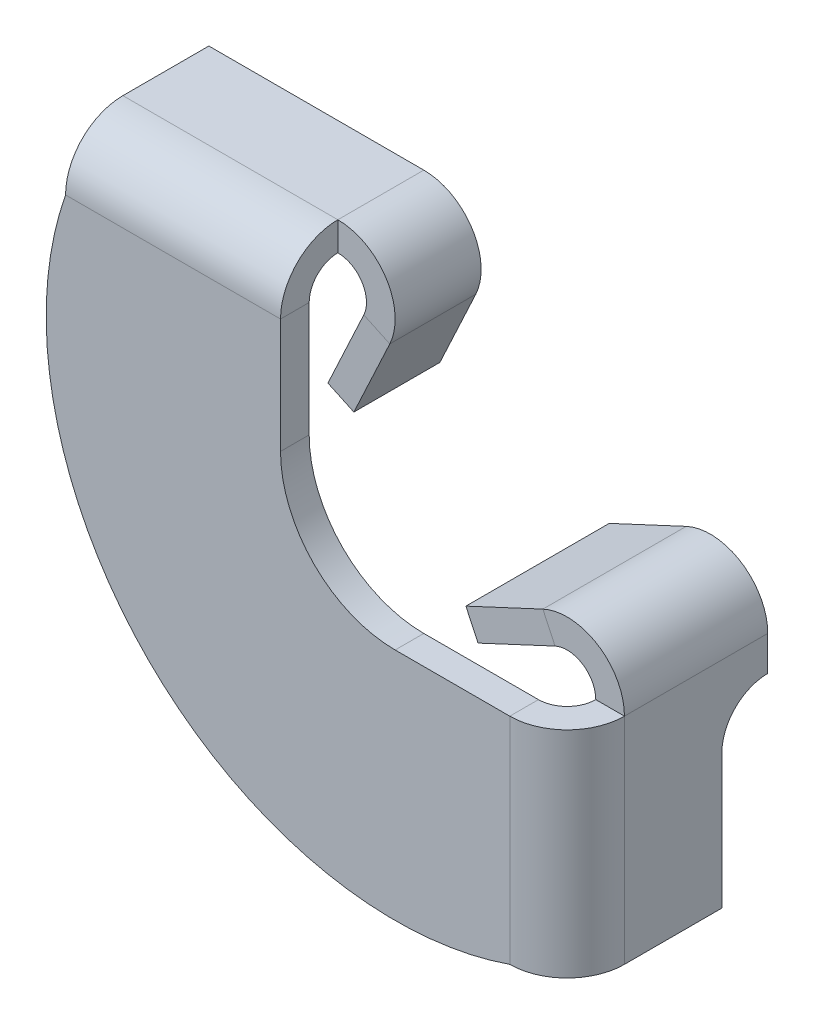
ISO-10303-21;
HEADER;
FILE_DESCRIPTION(('STEP AP214'),'2;1');
FILE_NAME('part.step','',(''),(''),'','','');
FILE_SCHEMA(('AUTOMOTIVE_DESIGN { 1 0 10303 214 1 1 1 1 }'));
ENDSEC;
DATA;
#1=APPLICATION_CONTEXT('core data for automotive mechanical design processes');
#2=APPLICATION_PROTOCOL_DEFINITION('international standard','automotive_design',2000,#1);
#3=PRODUCT_CONTEXT('',#1,'mechanical');
#4=PRODUCT('Part','Part','',(#3));
#5=PRODUCT_RELATED_PRODUCT_CATEGORY('part','',(#4));
#6=PRODUCT_DEFINITION_FORMATION('','',#4);
#7=PRODUCT_DEFINITION_CONTEXT('part definition',#1,'design');
#8=PRODUCT_DEFINITION('design','',#6,#7);
#9=PRODUCT_DEFINITION_SHAPE('','',#8);
#10=(LENGTH_UNIT() NAMED_UNIT(*) SI_UNIT(.MILLI.,.METRE.));
#11=(NAMED_UNIT(*) PLANE_ANGLE_UNIT() SI_UNIT($,.RADIAN.));
#12=(NAMED_UNIT(*) SI_UNIT($,.STERADIAN.) SOLID_ANGLE_UNIT());
#13=UNCERTAINTY_MEASURE_WITH_UNIT(LENGTH_MEASURE(1.E-05),#10,'distance_accuracy_value','');
#14=(GEOMETRIC_REPRESENTATION_CONTEXT(3) GLOBAL_UNCERTAINTY_ASSIGNED_CONTEXT((#13)) GLOBAL_UNIT_ASSIGNED_CONTEXT((#10,
#11,#12)) REPRESENTATION_CONTEXT('',''));
#15=CARTESIAN_POINT('',(0.,0.,0.));
#16=DIRECTION('',(0.,0.,1.));
#17=DIRECTION('',(1.,0.,0.));
#18=AXIS2_PLACEMENT_3D('',#15,#16,#17);
#19=CARTESIAN_POINT('',(8.,-7.99999999999995,6.));
#20=DIRECTION('',(0.,-1.,0.));
#21=DIRECTION('',(1.,0.,0.));
#22=AXIS2_PLACEMENT_3D('',#19,#20,#21);
#23=PLANE('',#22);
#24=DIRECTION('',(1.,0.,0.));
#25=VECTOR('',#24,1.);
#26=CARTESIAN_POINT('',(12.,-7.99999999999997,6.));
#27=LINE('',#26,#25);
#28=CARTESIAN_POINT('',(10.,-7.99999999999997,6.));
#29=VERTEX_POINT('',#28);
#30=CARTESIAN_POINT('',(12.,-7.99999999999997,6.));
#31=VERTEX_POINT('',#30);
#32=EDGE_CURVE('E11',#29,#31,#27,.T.);
#33=ORIENTED_EDGE('',*,*,#32,.F.);
#34=CARTESIAN_POINT('',(8.,-7.99999999999997,6.));
#35=DIRECTION('',(0.,1.,0.));
#36=DIRECTION('',(-1.,0.,0.));
#37=AXIS2_PLACEMENT_3D('',#34,#35,#36);
#38=CIRCLE('',#37,2.);
#39=CARTESIAN_POINT('',(8.,-8.00000000000002,8.));
#40=VERTEX_POINT('',#39);
#41=EDGE_CURVE('E136',#29,#40,#38,.F.);
#42=ORIENTED_EDGE('',*,*,#41,.T.);
#43=DIRECTION('',(0.,0.,1.));
#44=VECTOR('',#43,1.);
#45=CARTESIAN_POINT('',(8.,-8.00000000000002,10.));
#46=LINE('',#45,#44);
#47=CARTESIAN_POINT('',(8.,-8.00000000000002,10.));
#48=VERTEX_POINT('',#47);
#49=EDGE_CURVE('E49',#40,#48,#46,.T.);
#50=ORIENTED_EDGE('',*,*,#49,.T.);
#51=CARTESIAN_POINT('',(8.,-7.99999999999995,6.));
#52=DIRECTION('',(0.,1.,0.));
#53=DIRECTION('',(-1.,0.,0.));
#54=AXIS2_PLACEMENT_3D('',#51,#52,#53);
#55=CIRCLE('',#54,4.);
#56=EDGE_CURVE('E139',#31,#48,#55,.F.);
#57=ORIENTED_EDGE('',*,*,#56,.F.);
#58=EDGE_LOOP('',(#33,#42,#50,#57));
#59=FACE_BOUND('',#58,.T.);
#60=ADVANCED_FACE('F39',(#59),#23,.F.);
#61=CARTESIAN_POINT('',(1.45916076828845,-8.,10.));
#62=DIRECTION('',(0.,-1.,0.));
#63=DIRECTION('',(-1.,0.,0.));
#64=AXIS2_PLACEMENT_3D('',#61,#62,#63);
#65=PLANE('',#64);
#66=ORIENTED_EDGE('',*,*,#49,.F.);
#67=DIRECTION('',(-1.,0.,0.));
#68=VECTOR('',#67,1.);
#69=CARTESIAN_POINT('',(0.,-8.00000000000002,8.));
#70=LINE('',#69,#68);
#71=CARTESIAN_POINT('',(0.,-7.99999999999999,8.));
#72=VERTEX_POINT('',#71);
#73=EDGE_CURVE('E348',#40,#72,#70,.T.);
#74=ORIENTED_EDGE('',*,*,#73,.T.);
#75=DIRECTION('',(0.,0.,1.));
#76=VECTOR('',#75,1.);
#77=CARTESIAN_POINT('',(0.,-7.99999999999999,10.));
#78=LINE('',#77,#76);
#79=CARTESIAN_POINT('',(0.,-7.99999999999999,10.));
#80=VERTEX_POINT('',#79);
#81=EDGE_CURVE('E250',#72,#80,#78,.T.);
#82=ORIENTED_EDGE('',*,*,#81,.T.);
#83=DIRECTION('',(-1.,0.,0.));
#84=VECTOR('',#83,1.);
#85=CARTESIAN_POINT('',(1.45916076828845,-8.,10.));
#86=LINE('',#85,#84);
#87=EDGE_CURVE('E268',#48,#80,#86,.T.);
#88=ORIENTED_EDGE('',*,*,#87,.F.);
#89=EDGE_LOOP('',(#66,#74,#82,#88));
#90=FACE_BOUND('',#89,.T.);
#91=ADVANCED_FACE('F269',(#90),#65,.F.);
#92=CARTESIAN_POINT('',(0.,0.,10.));
#93=DIRECTION('',(0.,0.,-1.));
#94=DIRECTION('',(-1.,0.,0.));
#95=AXIS2_PLACEMENT_3D('',#92,#93,#94);
#96=CYLINDRICAL_SURFACE('',#95,8.);
#97=ORIENTED_EDGE('',*,*,#81,.F.);
#98=CARTESIAN_POINT('',(0.,0.,8.));
#99=DIRECTION('',(0.,0.,-1.));
#100=DIRECTION('',(-1.,0.,0.));
#101=AXIS2_PLACEMENT_3D('',#98,#99,#100);
#102=CIRCLE('',#101,8.);
#103=CARTESIAN_POINT('',(-8.,0.,8.));
#104=VERTEX_POINT('',#103);
#105=EDGE_CURVE('E353',#72,#104,#102,.T.);
#106=ORIENTED_EDGE('',*,*,#105,.T.);
#107=DIRECTION('',(0.,0.,1.));
#108=VECTOR('',#107,1.);
#109=CARTESIAN_POINT('',(-8.,0.,10.));
#110=LINE('',#109,#108);
#111=CARTESIAN_POINT('',(-8.,0.,10.));
#112=VERTEX_POINT('',#111);
#113=EDGE_CURVE('E247',#104,#112,#110,.T.);
#114=ORIENTED_EDGE('',*,*,#113,.T.);
#115=CARTESIAN_POINT('',(0.,0.,10.));
#116=DIRECTION('',(0.,0.,-1.));
#117=DIRECTION('',(-1.,0.,0.));
#118=AXIS2_PLACEMENT_3D('',#115,#116,#117);
#119=CIRCLE('',#118,8.);
#120=EDGE_CURVE('E273',#80,#112,#119,.T.);
#121=ORIENTED_EDGE('',*,*,#120,.F.);
#122=EDGE_LOOP('',(#97,#106,#114,#121));
#123=FACE_BOUND('',#122,.T.);
#124=ADVANCED_FACE('F362',(#123),#96,.F.);
#125=CARTESIAN_POINT('',(-8.,0.,10.));
#126=DIRECTION('',(-1.,0.,0.));
#127=DIRECTION('',(0.,1.,0.));
#128=AXIS2_PLACEMENT_3D('',#125,#126,#127);
#129=PLANE('',#128);
#130=ORIENTED_EDGE('',*,*,#113,.F.);
#131=DIRECTION('',(0.,1.,0.));
#132=VECTOR('',#131,1.);
#133=CARTESIAN_POINT('',(-8.,0.,8.));
#134=LINE('',#133,#132);
#135=CARTESIAN_POINT('',(-8.,7.99999999999997,8.));
#136=VERTEX_POINT('',#135);
#137=EDGE_CURVE('E330',#104,#136,#134,.T.);
#138=ORIENTED_EDGE('',*,*,#137,.T.);
#139=DIRECTION('',(0.,0.,1.));
#140=VECTOR('',#139,1.);
#141=CARTESIAN_POINT('',(-8.,7.99999999999997,10.));
#142=LINE('',#141,#140);
#143=CARTESIAN_POINT('',(-8.,7.99999999999997,10.));
#144=VERTEX_POINT('',#143);
#145=EDGE_CURVE('E244',#136,#144,#142,.T.);
#146=ORIENTED_EDGE('',*,*,#145,.T.);
#147=DIRECTION('',(0.,1.,0.));
#148=VECTOR('',#147,1.);
#149=CARTESIAN_POINT('',(-8.,0.,10.));
#150=LINE('',#149,#148);
#151=EDGE_CURVE('E367',#112,#144,#150,.T.);
#152=ORIENTED_EDGE('',*,*,#151,.F.);
#153=EDGE_LOOP('',(#130,#138,#146,#152));
#154=FACE_BOUND('',#153,.T.);
#155=ADVANCED_FACE('F508',(#154),#129,.F.);
#156=CARTESIAN_POINT('',(-8.,7.99999999999997,6.));
#157=DIRECTION('',(1.,0.,0.));
#158=DIRECTION('',(0.,0.,-1.));
#159=AXIS2_PLACEMENT_3D('',#156,#157,#158);
#160=PLANE('',#159);
#161=ORIENTED_EDGE('',*,*,#145,.F.);
#162=CARTESIAN_POINT('',(-8.,7.99999999999997,6.));
#163=DIRECTION('',(-1.,0.,0.));
#164=DIRECTION('',(0.,-1.,0.));
#165=AXIS2_PLACEMENT_3D('',#162,#163,#164);
#166=CIRCLE('',#165,2.);
#167=CARTESIAN_POINT('',(-7.99999999999999,9.99999999999997,6.));
#168=VERTEX_POINT('',#167);
#169=EDGE_CURVE('E188',#136,#168,#166,.T.);
#170=ORIENTED_EDGE('',*,*,#169,.T.);
#171=DIRECTION('',(0.,1.,0.));
#172=VECTOR('',#171,1.);
#173=CARTESIAN_POINT('',(-8.,12.,6.));
#174=LINE('',#173,#172);
#175=CARTESIAN_POINT('',(-8.,12.,6.));
#176=VERTEX_POINT('',#175);
#177=EDGE_CURVE('E241',#168,#176,#174,.T.);
#178=ORIENTED_EDGE('',*,*,#177,.T.);
#179=CARTESIAN_POINT('',(-8.,7.99999999999997,6.));
#180=DIRECTION('',(-1.,0.,0.));
#181=DIRECTION('',(0.,0.,1.));
#182=AXIS2_PLACEMENT_3D('',#179,#180,#181);
#183=CIRCLE('',#182,4.);
#184=EDGE_CURVE('E288',#144,#176,#183,.T.);
#185=ORIENTED_EDGE('',*,*,#184,.F.);
#186=EDGE_LOOP('',(#161,#170,#178,#185));
#187=FACE_BOUND('',#186,.T.);
#188=ADVANCED_FACE('F509',(#187),#160,.T.);
#189=CARTESIAN_POINT('',(-8.,7.99999999999997,6.));
#190=DIRECTION('',(0.,0.,-1.));
#191=DIRECTION('',(-1.,0.,0.));
#192=AXIS2_PLACEMENT_3D('',#189,#190,#191);
#193=PLANE('',#192);
#194=ORIENTED_EDGE('',*,*,#177,.F.);
#195=CARTESIAN_POINT('',(-8.,7.99999999999997,6.));
#196=DIRECTION('',(0.,0.,-1.));
#197=DIRECTION('',(-1.,0.,0.));
#198=AXIS2_PLACEMENT_3D('',#195,#196,#197);
#199=CIRCLE('',#198,2.);
#200=CARTESIAN_POINT('',(-6.1873844259267,7.15476347651857,6.));
#201=VERTEX_POINT('',#200);
#202=EDGE_CURVE('E186',#168,#201,#199,.T.);
#203=ORIENTED_EDGE('',*,*,#202,.T.);
#204=DIRECTION('',(0.906307787036649,-0.4226182617407,0.));
#205=VECTOR('',#204,1.);
#206=CARTESIAN_POINT('',(-4.3747688518534,6.30952695303717,6.));
#207=LINE('',#206,#205);
#208=CARTESIAN_POINT('',(-4.3747688518534,6.30952695303717,6.));
#209=VERTEX_POINT('',#208);
#210=EDGE_CURVE('E238',#201,#209,#207,.T.);
#211=ORIENTED_EDGE('',*,*,#210,.T.);
#212=CARTESIAN_POINT('',(-8.,7.99999999999997,6.));
#213=DIRECTION('',(0.,0.,1.));
#214=DIRECTION('',(1.,0.,0.));
#215=AXIS2_PLACEMENT_3D('',#212,#213,#214);
#216=CIRCLE('',#215,4.);
#217=EDGE_CURVE('E274',#176,#209,#216,.F.);
#218=ORIENTED_EDGE('',*,*,#217,.F.);
#219=EDGE_LOOP('',(#194,#203,#211,#218));
#220=FACE_BOUND('',#219,.T.);
#221=ADVANCED_FACE('F445',(#220),#193,.F.);
#222=CARTESIAN_POINT('',(-1.72125769153002,12.,6.));
#223=DIRECTION('',(0.,0.,1.));
#224=DIRECTION('',(0.4226182617407,0.906307787036649,0.));
#225=AXIS2_PLACEMENT_3D('',#222,#223,#224);
#226=PLANE('',#225);
#227=ORIENTED_EDGE('',*,*,#210,.F.);
#228=DIRECTION('',(-0.4226182617407,-0.906307787036649,0.));
#229=VECTOR('',#228,1.);
#230=CARTESIAN_POINT('',(-3.53387326560332,12.8452365234814,6.));
#231=LINE('',#230,#229);
#232=CARTESIAN_POINT('',(-8.69267119932032,1.7821586531149,6.));
#233=VERTEX_POINT('',#232);
#234=EDGE_CURVE('E336',#233,#201,#231,.F.);
#235=ORIENTED_EDGE('',*,*,#234,.F.);
#236=DIRECTION('',(0.906307787036649,-0.4226182617407,0.));
#237=VECTOR('',#236,1.);
#238=CARTESIAN_POINT('',(-6.88005562524703,0.936922129633496,6.));
#239=LINE('',#238,#237);
#240=CARTESIAN_POINT('',(-6.88005562524703,0.936922129633496,6.));
#241=VERTEX_POINT('',#240);
#242=EDGE_CURVE('E235',#233,#241,#239,.T.);
#243=ORIENTED_EDGE('',*,*,#242,.T.);
#244=DIRECTION('',(0.4226182617407,0.906307787036649,0.));
#245=VECTOR('',#244,1.);
#246=CARTESIAN_POINT('',(-1.72125769153002,12.,6.));
#247=LINE('',#246,#245);
#248=EDGE_CURVE('E390',#241,#209,#247,.T.);
#249=ORIENTED_EDGE('',*,*,#248,.T.);
#250=EDGE_LOOP('',(#227,#235,#243,#249));
#251=FACE_BOUND('',#250,.T.);
#252=ADVANCED_FACE('F516',(#251),#226,.T.);
#253=CARTESIAN_POINT('',(-6.88005562524703,0.936922129633496,10.));
#254=DIRECTION('',(0.4226182617407,0.906307787036649,0.));
#255=DIRECTION('',(0.,0.,-1.));
#256=AXIS2_PLACEMENT_3D('',#253,#254,#255);
#257=PLANE('',#256);
#258=ORIENTED_EDGE('',*,*,#242,.F.);
#259=DIRECTION('',(0.,0.,1.));
#260=VECTOR('',#259,1.);
#261=CARTESIAN_POINT('',(-8.69267119932032,1.7821586531149,10.));
#262=LINE('',#261,#260);
#263=CARTESIAN_POINT('',(-8.69267119932032,1.7821586531149,0.));
#264=VERTEX_POINT('',#263);
#265=EDGE_CURVE('E341',#233,#264,#262,.F.);
#266=ORIENTED_EDGE('',*,*,#265,.T.);
#267=DIRECTION('',(0.906307787036649,-0.4226182617407,0.));
#268=VECTOR('',#267,1.);
#269=CARTESIAN_POINT('',(-6.88005562524703,0.936922129633496,0.));
#270=LINE('',#269,#268);
#271=CARTESIAN_POINT('',(-6.88005562524703,0.936922129633496,0.));
#272=VERTEX_POINT('',#271);
#273=EDGE_CURVE('E232',#264,#272,#270,.T.);
#274=ORIENTED_EDGE('',*,*,#273,.T.);
#275=DIRECTION('',(0.,0.,-1.));
#276=VECTOR('',#275,1.);
#277=CARTESIAN_POINT('',(-6.88005562524703,0.936922129633496,10.));
#278=LINE('',#277,#276);
#279=EDGE_CURVE('E393',#241,#272,#278,.T.);
#280=ORIENTED_EDGE('',*,*,#279,.F.);
#281=EDGE_LOOP('',(#258,#266,#274,#280));
#282=FACE_BOUND('',#281,.T.);
#283=ADVANCED_FACE('F556',(#282),#257,.F.);
#284=CARTESIAN_POINT('',(-1.72125769153002,12.,0.));
#285=DIRECTION('',(0.,0.,1.));
#286=DIRECTION('',(0.4226182617407,0.906307787036649,0.));
#287=AXIS2_PLACEMENT_3D('',#284,#285,#286);
#288=PLANE('',#287);
#289=ORIENTED_EDGE('',*,*,#273,.F.);
#290=DIRECTION('',(-0.4226182617407,-0.906307787036649,0.));
#291=VECTOR('',#290,1.);
#292=CARTESIAN_POINT('',(-3.53387326560332,12.8452365234814,0.));
#293=LINE('',#292,#291);
#294=CARTESIAN_POINT('',(-6.1873844259267,7.15476347651857,0.));
#295=VERTEX_POINT('',#294);
#296=EDGE_CURVE('E313',#264,#295,#293,.F.);
#297=ORIENTED_EDGE('',*,*,#296,.T.);
#298=DIRECTION('',(0.906307787036649,-0.4226182617407,0.));
#299=VECTOR('',#298,1.);
#300=CARTESIAN_POINT('',(-4.3747688518534,6.30952695303717,0.));
#301=LINE('',#300,#299);
#302=CARTESIAN_POINT('',(-4.3747688518534,6.30952695303717,0.));
#303=VERTEX_POINT('',#302);
#304=EDGE_CURVE('E229',#295,#303,#301,.T.);
#305=ORIENTED_EDGE('',*,*,#304,.T.);
#306=DIRECTION('',(0.4226182617407,0.906307787036649,0.));
#307=VECTOR('',#306,1.);
#308=CARTESIAN_POINT('',(-1.72125769153002,12.,0.));
#309=LINE('',#308,#307);
#310=EDGE_CURVE('E396',#272,#303,#309,.T.);
#311=ORIENTED_EDGE('',*,*,#310,.F.);
#312=EDGE_LOOP('',(#289,#297,#305,#311));
#313=FACE_BOUND('',#312,.T.);
#314=ADVANCED_FACE('F567',(#313),#288,.F.);
#315=CARTESIAN_POINT('',(-8.,7.99999999999997,0.));
#316=DIRECTION('',(0.,0.,1.));
#317=DIRECTION('',(1.,0.,0.));
#318=AXIS2_PLACEMENT_3D('',#315,#316,#317);
#319=PLANE('',#318);
#320=ORIENTED_EDGE('',*,*,#304,.F.);
#321=CARTESIAN_POINT('',(-8.,7.99999999999997,0.));
#322=DIRECTION('',(0.,0.,-1.));
#323=DIRECTION('',(-1.,0.,0.));
#324=AXIS2_PLACEMENT_3D('',#321,#322,#323);
#325=CIRCLE('',#324,2.);
#326=CARTESIAN_POINT('',(-8.00000000000001,9.99999999999997,0.));
#327=VERTEX_POINT('',#326);
#328=EDGE_CURVE('E183',#295,#327,#325,.F.);
#329=ORIENTED_EDGE('',*,*,#328,.T.);
#330=DIRECTION('',(0.,1.,0.));
#331=VECTOR('',#330,1.);
#332=CARTESIAN_POINT('',(-8.00000000000002,12.,0.));
#333=LINE('',#332,#331);
#334=CARTESIAN_POINT('',(-8.00000000000002,12.,0.));
#335=VERTEX_POINT('',#334);
#336=EDGE_CURVE('E226',#327,#335,#333,.T.);
#337=ORIENTED_EDGE('',*,*,#336,.T.);
#338=CARTESIAN_POINT('',(-8.,7.99999999999997,0.));
#339=DIRECTION('',(0.,0.,-1.));
#340=DIRECTION('',(-1.,0.,0.));
#341=AXIS2_PLACEMENT_3D('',#338,#339,#340);
#342=CIRCLE('',#341,4.);
#343=EDGE_CURVE('E415',#303,#335,#342,.F.);
#344=ORIENTED_EDGE('',*,*,#343,.F.);
#345=EDGE_LOOP('',(#320,#329,#337,#344));
#346=FACE_BOUND('',#345,.T.);
#347=ADVANCED_FACE('F578',(#346),#319,.F.);
#348=CARTESIAN_POINT('',(-23.,11.9999999999999,0.));
#349=DIRECTION('',(0.,0.,1.));
#350=DIRECTION('',(-1.,0.,0.));
#351=AXIS2_PLACEMENT_3D('',#348,#349,#350);
#352=PLANE('',#351);
#353=ORIENTED_EDGE('',*,*,#336,.F.);
#354=DIRECTION('',(1.,0.,0.));
#355=VECTOR('',#354,1.);
#356=CARTESIAN_POINT('',(-23.,9.99999999999991,0.));
#357=LINE('',#356,#355);
#358=CARTESIAN_POINT('',(-23.,9.99999999999991,0.));
#359=VERTEX_POINT('',#358);
#360=EDGE_CURVE('E318',#327,#359,#357,.F.);
#361=ORIENTED_EDGE('',*,*,#360,.T.);
#362=DIRECTION('',(0.,1.,0.));
#363=VECTOR('',#362,1.);
#364=CARTESIAN_POINT('',(-23.,11.9999999999999,0.));
#365=LINE('',#364,#363);
#366=CARTESIAN_POINT('',(-23.,11.9999999999999,0.));
#367=VERTEX_POINT('',#366);
#368=EDGE_CURVE('E223',#359,#367,#365,.T.);
#369=ORIENTED_EDGE('',*,*,#368,.T.);
#370=DIRECTION('',(-1.,0.,0.));
#371=VECTOR('',#370,1.);
#372=CARTESIAN_POINT('',(-23.,11.9999999999999,0.));
#373=LINE('',#372,#371);
#374=EDGE_CURVE('E384',#335,#367,#373,.T.);
#375=ORIENTED_EDGE('',*,*,#374,.F.);
#376=EDGE_LOOP('',(#353,#361,#369,#375));
#377=FACE_BOUND('',#376,.T.);
#378=ADVANCED_FACE('F462',(#377),#352,.F.);
#379=CARTESIAN_POINT('',(-23.,11.9999999999999,10.));
#380=DIRECTION('',(-1.,0.,0.));
#381=DIRECTION('',(0.,0.,-1.));
#382=AXIS2_PLACEMENT_3D('',#379,#380,#381);
#383=PLANE('',#382);
#384=ORIENTED_EDGE('',*,*,#368,.F.);
#385=DIRECTION('',(0.,0.,1.));
#386=VECTOR('',#385,1.);
#387=CARTESIAN_POINT('',(-23.,9.99999999999991,10.));
#388=LINE('',#387,#386);
#389=CARTESIAN_POINT('',(-23.,9.99999999999991,6.));
#390=VERTEX_POINT('',#389);
#391=EDGE_CURVE('E333',#390,#359,#388,.F.);
#392=ORIENTED_EDGE('',*,*,#391,.F.);
#393=DIRECTION('',(0.,1.,0.));
#394=VECTOR('',#393,1.);
#395=CARTESIAN_POINT('',(-23.,11.9999999999999,6.));
#396=LINE('',#395,#394);
#397=CARTESIAN_POINT('',(-23.,11.9999999999999,6.));
#398=VERTEX_POINT('',#397);
#399=EDGE_CURVE('E220',#390,#398,#396,.T.);
#400=ORIENTED_EDGE('',*,*,#399,.T.);
#401=DIRECTION('',(0.,0.,-1.));
#402=VECTOR('',#401,1.);
#403=CARTESIAN_POINT('',(-23.,11.9999999999999,10.));
#404=LINE('',#403,#402);
#405=EDGE_CURVE('E387',#398,#367,#404,.T.);
#406=ORIENTED_EDGE('',*,*,#405,.T.);
#407=EDGE_LOOP('',(#384,#392,#400,#406));
#408=FACE_BOUND('',#407,.T.);
#409=ADVANCED_FACE('F466',(#408),#383,.T.);
#410=CARTESIAN_POINT('',(-23.,7.99999999999991,6.));
#411=DIRECTION('',(-1.,0.,0.));
#412=DIRECTION('',(0.,-1.,0.));
#413=AXIS2_PLACEMENT_3D('',#410,#411,#412);
#414=PLANE('',#413);
#415=ORIENTED_EDGE('',*,*,#399,.F.);
#416=CARTESIAN_POINT('',(-23.,7.99999999999991,6.));
#417=DIRECTION('',(-1.,0.,0.));
#418=DIRECTION('',(0.,-1.,0.));
#419=AXIS2_PLACEMENT_3D('',#416,#417,#418);
#420=CIRCLE('',#419,2.);
#421=CARTESIAN_POINT('',(-23.,7.99999999999991,8.));
#422=VERTEX_POINT('',#421);
#423=EDGE_CURVE('E327',#390,#422,#420,.F.);
#424=ORIENTED_EDGE('',*,*,#423,.T.);
#425=DIRECTION('',(0.,0.,1.));
#426=VECTOR('',#425,1.);
#427=CARTESIAN_POINT('',(-23.,7.99999999999991,10.));
#428=LINE('',#427,#426);
#429=CARTESIAN_POINT('',(-23.,7.99999999999991,10.));
#430=VERTEX_POINT('',#429);
#431=EDGE_CURVE('E217',#422,#430,#428,.T.);
#432=ORIENTED_EDGE('',*,*,#431,.T.);
#433=CARTESIAN_POINT('',(-23.,7.99999999999991,6.));
#434=DIRECTION('',(1.,0.,0.));
#435=DIRECTION('',(0.,1.,0.));
#436=AXIS2_PLACEMENT_3D('',#433,#434,#435);
#437=CIRCLE('',#436,4.);
#438=EDGE_CURVE('E292',#398,#430,#437,.T.);
#439=ORIENTED_EDGE('',*,*,#438,.F.);
#440=EDGE_LOOP('',(#415,#424,#432,#439));
#441=FACE_BOUND('',#440,.T.);
#442=ADVANCED_FACE('F470',(#441),#414,.T.);
#443=CARTESIAN_POINT('',(0.,0.,10.));
#444=DIRECTION('',(0.,0.,1.));
#445=DIRECTION('',(1.,0.,0.));
#446=AXIS2_PLACEMENT_3D('',#443,#444,#445);
#447=CYLINDRICAL_SURFACE('',#446,24.3515913237718);
#448=ORIENTED_EDGE('',*,*,#431,.F.);
#449=CARTESIAN_POINT('',(0.,0.,8.));
#450=DIRECTION('',(0.,0.,1.));
#451=DIRECTION('',(1.,0.,0.));
#452=AXIS2_PLACEMENT_3D('',#449,#450,#451);
#453=CIRCLE('',#452,24.3515913237718);
#454=CARTESIAN_POINT('',(8.,-23.,8.));
#455=VERTEX_POINT('',#454);
#456=EDGE_CURVE('E325',#422,#455,#453,.T.);
#457=ORIENTED_EDGE('',*,*,#456,.T.);
#458=DIRECTION('',(0.,0.,1.));
#459=VECTOR('',#458,1.);
#460=CARTESIAN_POINT('',(8.,-23.,10.));
#461=LINE('',#460,#459);
#462=CARTESIAN_POINT('',(8.,-23.,10.));
#463=VERTEX_POINT('',#462);
#464=EDGE_CURVE('E214',#455,#463,#461,.T.);
#465=ORIENTED_EDGE('',*,*,#464,.T.);
#466=CARTESIAN_POINT('',(0.,0.,10.));
#467=DIRECTION('',(0.,0.,1.));
#468=DIRECTION('',(1.,0.,0.));
#469=AXIS2_PLACEMENT_3D('',#466,#467,#468);
#470=CIRCLE('',#469,24.3515913237718);
#471=EDGE_CURVE('E280',#430,#463,#470,.T.);
#472=ORIENTED_EDGE('',*,*,#471,.F.);
#473=EDGE_LOOP('',(#448,#457,#465,#472));
#474=FACE_BOUND('',#473,.T.);
#475=ADVANCED_FACE('F481',(#474),#447,.T.);
#476=CARTESIAN_POINT('',(8.,-23.,6.));
#477=DIRECTION('',(0.,1.,0.));
#478=DIRECTION('',(0.,0.,1.));
#479=AXIS2_PLACEMENT_3D('',#476,#477,#478);
#480=PLANE('',#479);
#481=ORIENTED_EDGE('',*,*,#464,.F.);
#482=CARTESIAN_POINT('',(8.,-23.,6.));
#483=DIRECTION('',(0.,1.,0.));
#484=DIRECTION('',(-1.,0.,0.));
#485=AXIS2_PLACEMENT_3D('',#482,#483,#484);
#486=CIRCLE('',#485,2.);
#487=CARTESIAN_POINT('',(10.,-23.,6.));
#488=VERTEX_POINT('',#487);
#489=EDGE_CURVE('E178',#455,#488,#486,.T.);
#490=ORIENTED_EDGE('',*,*,#489,.T.);
#491=DIRECTION('',(1.,0.,0.));
#492=VECTOR('',#491,1.);
#493=CARTESIAN_POINT('',(12.,-23.,6.));
#494=LINE('',#493,#492);
#495=CARTESIAN_POINT('',(12.,-23.,6.));
#496=VERTEX_POINT('',#495);
#497=EDGE_CURVE('E57',#488,#496,#494,.T.);
#498=ORIENTED_EDGE('',*,*,#497,.T.);
#499=CARTESIAN_POINT('',(8.,-23.,6.));
#500=DIRECTION('',(0.,-1.,0.));
#501=DIRECTION('',(0.,0.,-1.));
#502=AXIS2_PLACEMENT_3D('',#499,#500,#501);
#503=CIRCLE('',#502,4.);
#504=EDGE_CURVE('E265',#463,#496,#503,.F.);
#505=ORIENTED_EDGE('',*,*,#504,.F.);
#506=EDGE_LOOP('',(#481,#490,#498,#505));
#507=FACE_BOUND('',#506,.T.);
#508=ADVANCED_FACE('F625',(#507),#480,.F.);
#509=CARTESIAN_POINT('',(12.,-23.,10.));
#510=DIRECTION('',(0.,1.,0.));
#511=DIRECTION('',(0.,0.,-1.));
#512=AXIS2_PLACEMENT_3D('',#509,#510,#511);
#513=PLANE('',#512);
#514=ORIENTED_EDGE('',*,*,#497,.F.);
#515=DIRECTION('',(0.,0.,1.));
#516=VECTOR('',#515,1.);
#517=CARTESIAN_POINT('',(10.,-23.,10.));
#518=LINE('',#517,#516);
#519=CARTESIAN_POINT('',(10.,-23.,-0.799108406434622));
#520=VERTEX_POINT('',#519);
#521=EDGE_CURVE('E157',#488,#520,#518,.F.);
#522=ORIENTED_EDGE('',*,*,#521,.T.);
#523=DIRECTION('',(1.,0.,0.));
#524=VECTOR('',#523,1.);
#525=CARTESIAN_POINT('',(12.,-23.,-0.799108406434622));
#526=LINE('',#525,#524);
#527=CARTESIAN_POINT('',(12.,-23.,-0.799108406434622));
#528=VERTEX_POINT('',#527);
#529=EDGE_CURVE('E210',#520,#528,#526,.T.);
#530=ORIENTED_EDGE('',*,*,#529,.T.);
#531=DIRECTION('',(0.,0.,-1.));
#532=VECTOR('',#531,1.);
#533=CARTESIAN_POINT('',(12.,-23.,10.));
#534=LINE('',#533,#532);
#535=EDGE_CURVE('E372',#496,#528,#534,.T.);
#536=ORIENTED_EDGE('',*,*,#535,.F.);
#537=EDGE_LOOP('',(#514,#522,#530,#536));
#538=FACE_BOUND('',#537,.T.);
#539=ADVANCED_FACE('F635',(#538),#513,.F.);
#540=CARTESIAN_POINT('',(12.,-23.,-0.799108406434622));
#541=DIRECTION('',(0.,0.,-1.));
#542=DIRECTION('',(0.,-1.,0.));
#543=AXIS2_PLACEMENT_3D('',#540,#541,#542);
#544=PLANE('',#543);
#545=ORIENTED_EDGE('',*,*,#529,.F.);
#546=DIRECTION('',(0.,-1.,0.));
#547=VECTOR('',#546,1.);
#548=CARTESIAN_POINT('',(10.,-23.,-0.799108406434622));
#549=LINE('',#548,#547);
#550=CARTESIAN_POINT('',(10.,-13.6188963225692,-0.799108406434622));
#551=VERTEX_POINT('',#550);
#552=EDGE_CURVE('E322',#551,#520,#549,.T.);
#553=ORIENTED_EDGE('',*,*,#552,.F.);
#554=DIRECTION('',(1.,0.,0.));
#555=VECTOR('',#554,1.);
#556=CARTESIAN_POINT('',(12.,-13.6188963225692,-0.799108406434622));
#557=LINE('',#556,#555);
#558=CARTESIAN_POINT('',(12.,-13.6188963225692,-0.799108406434622));
#559=VERTEX_POINT('',#558);
#560=EDGE_CURVE('E207',#551,#559,#557,.T.);
#561=ORIENTED_EDGE('',*,*,#560,.T.);
#562=DIRECTION('',(0.,-1.,0.));
#563=VECTOR('',#562,1.);
#564=CARTESIAN_POINT('',(12.,-23.,-0.799108406434622));
#565=LINE('',#564,#563);
#566=EDGE_CURVE('E375',#559,#528,#565,.T.);
#567=ORIENTED_EDGE('',*,*,#566,.T.);
#568=EDGE_LOOP('',(#545,#553,#561,#567));
#569=FACE_BOUND('',#568,.T.);
#570=ADVANCED_FACE('F645',(#569),#544,.T.);
#571=CARTESIAN_POINT('',(12.,-13.6188963225692,-4.));
#572=DIRECTION('',(1.,0.,0.));
#573=DIRECTION('',(0.,1.,0.));
#574=AXIS2_PLACEMENT_3D('',#571,#572,#573);
#575=CYLINDRICAL_SURFACE('',#574,3.20089159356538);
#576=ORIENTED_EDGE('',*,*,#560,.F.);
#577=CARTESIAN_POINT('',(10.,-13.6188963225692,-4.));
#578=DIRECTION('',(1.,0.,0.));
#579=DIRECTION('',(0.,1.,0.));
#580=AXIS2_PLACEMENT_3D('',#577,#578,#579);
#581=CIRCLE('',#580,3.20089159356538);
#582=CARTESIAN_POINT('',(10.,-10.4180047290038,-4.));
#583=VERTEX_POINT('',#582);
#584=EDGE_CURVE('E319',#583,#551,#581,.T.);
#585=ORIENTED_EDGE('',*,*,#584,.F.);
#586=DIRECTION('',(1.,0.,0.));
#587=VECTOR('',#586,1.);
#588=CARTESIAN_POINT('',(12.,-10.4180047290038,-4.));
#589=LINE('',#588,#587);
#590=CARTESIAN_POINT('',(12.,-10.4180047290038,-4.));
#591=VERTEX_POINT('',#590);
#592=EDGE_CURVE('E204',#583,#591,#589,.T.);
#593=ORIENTED_EDGE('',*,*,#592,.T.);
#594=CARTESIAN_POINT('',(12.,-13.6188963225692,-4.));
#595=DIRECTION('',(1.,0.,0.));
#596=DIRECTION('',(0.,1.,0.));
#597=AXIS2_PLACEMENT_3D('',#594,#595,#596);
#598=CIRCLE('',#597,3.20089159356538);
#599=EDGE_CURVE('E378',#591,#559,#598,.T.);
#600=ORIENTED_EDGE('',*,*,#599,.T.);
#601=EDGE_LOOP('',(#576,#585,#593,#600));
#602=FACE_BOUND('',#601,.T.);
#603=ADVANCED_FACE('F656',(#602),#575,.F.);
#604=CARTESIAN_POINT('',(12.,-23.,-4.));
#605=DIRECTION('',(0.,0.,-1.));
#606=DIRECTION('',(0.,-1.,0.));
#607=AXIS2_PLACEMENT_3D('',#604,#605,#606);
#608=PLANE('',#607);
#609=ORIENTED_EDGE('',*,*,#592,.F.);
#610=DIRECTION('',(0.,-1.,0.));
#611=VECTOR('',#610,1.);
#612=CARTESIAN_POINT('',(10.,-23.,-4.));
#613=LINE('',#612,#611);
#614=CARTESIAN_POINT('',(10.,-7.99999999999997,-4.));
#615=VERTEX_POINT('',#614);
#616=EDGE_CURVE('E316',#615,#583,#613,.T.);
#617=ORIENTED_EDGE('',*,*,#616,.F.);
#618=DIRECTION('',(1.,0.,0.));
#619=VECTOR('',#618,1.);
#620=CARTESIAN_POINT('',(12.,-7.99999999999997,-4.));
#621=LINE('',#620,#619);
#622=CARTESIAN_POINT('',(12.,-7.99999999999997,-4.));
#623=VERTEX_POINT('',#622);
#624=EDGE_CURVE('E201',#615,#623,#621,.T.);
#625=ORIENTED_EDGE('',*,*,#624,.T.);
#626=DIRECTION('',(0.,-1.,0.));
#627=VECTOR('',#626,1.);
#628=CARTESIAN_POINT('',(12.,-23.,-4.));
#629=LINE('',#628,#627);
#630=EDGE_CURVE('E381',#623,#591,#629,.T.);
#631=ORIENTED_EDGE('',*,*,#630,.T.);
#632=EDGE_LOOP('',(#609,#617,#625,#631));
#633=FACE_BOUND('',#632,.T.);
#634=ADVANCED_FACE('F667',(#633),#608,.T.);
#635=CARTESIAN_POINT('',(8.,-7.99999999999997,-4.));
#636=DIRECTION('',(0.,0.,1.));
#637=DIRECTION('',(1.,0.,0.));
#638=AXIS2_PLACEMENT_3D('',#635,#636,#637);
#639=PLANE('',#638);
#640=ORIENTED_EDGE('',*,*,#624,.F.);
#641=CARTESIAN_POINT('',(8.,-7.99999999999997,-4.));
#642=DIRECTION('',(0.,0.,-1.));
#643=DIRECTION('',(-1.,0.,0.));
#644=AXIS2_PLACEMENT_3D('',#641,#642,#643);
#645=CIRCLE('',#644,2.);
#646=CARTESIAN_POINT('',(7.15476347651858,-6.18738442592668,-4.));
#647=VERTEX_POINT('',#646);
#648=EDGE_CURVE('E169',#615,#647,#645,.F.);
#649=ORIENTED_EDGE('',*,*,#648,.T.);
#650=DIRECTION('',(-0.422618261740708,0.906307787036646,0.));
#651=VECTOR('',#650,1.);
#652=CARTESIAN_POINT('',(6.30952695303717,-4.37476885185339,-4.));
#653=LINE('',#652,#651);
#654=CARTESIAN_POINT('',(6.30952695303717,-4.37476885185339,-4.));
#655=VERTEX_POINT('',#654);
#656=EDGE_CURVE('E198',#647,#655,#653,.T.);
#657=ORIENTED_EDGE('',*,*,#656,.T.);
#658=CARTESIAN_POINT('',(8.,-7.99999999999997,-4.));
#659=DIRECTION('',(0.,0.,-1.));
#660=DIRECTION('',(-1.,0.,0.));
#661=AXIS2_PLACEMENT_3D('',#658,#659,#660);
#662=CIRCLE('',#661,4.);
#663=EDGE_CURVE('E425',#623,#655,#662,.F.);
#664=ORIENTED_EDGE('',*,*,#663,.F.);
#665=EDGE_LOOP('',(#640,#649,#657,#664));
#666=FACE_BOUND('',#665,.T.);
#667=ADVANCED_FACE('F678',(#666),#639,.F.);
#668=CARTESIAN_POINT('',(12.,-1.72125769152995,-4.));
#669=DIRECTION('',(0.,0.,-1.));
#670=DIRECTION('',(0.906307787036646,0.422618261740707,0.));
#671=AXIS2_PLACEMENT_3D('',#668,#669,#670);
#672=PLANE('',#671);
#673=ORIENTED_EDGE('',*,*,#656,.F.);
#674=DIRECTION('',(0.906307787036646,0.422618261740708,0.));
#675=VECTOR('',#674,1.);
#676=CARTESIAN_POINT('',(12.8452365234814,-3.53387326560324,-4.00000000000001));
#677=LINE('',#676,#675);
#678=CARTESIAN_POINT('',(1.78215865311495,-8.69267119932034,-4.00000000000001));
#679=VERTEX_POINT('',#678);
#680=EDGE_CURVE('E304',#679,#647,#677,.T.);
#681=ORIENTED_EDGE('',*,*,#680,.F.);
#682=DIRECTION('',(-0.422618261740708,0.906307787036646,0.));
#683=VECTOR('',#682,1.);
#684=CARTESIAN_POINT('',(0.936922129633535,-6.88005562524705,-4.));
#685=LINE('',#684,#683);
#686=CARTESIAN_POINT('',(0.936922129633535,-6.88005562524705,-4.));
#687=VERTEX_POINT('',#686);
#688=EDGE_CURVE('E195',#679,#687,#685,.T.);
#689=ORIENTED_EDGE('',*,*,#688,.T.);
#690=DIRECTION('',(0.906307787036646,0.422618261740707,0.));
#691=VECTOR('',#690,1.);
#692=CARTESIAN_POINT('',(12.,-1.72125769152995,-4.));
#693=LINE('',#692,#691);
#694=EDGE_CURVE('E405',#687,#655,#693,.T.);
#695=ORIENTED_EDGE('',*,*,#694,.T.);
#696=EDGE_LOOP('',(#673,#681,#689,#695));
#697=FACE_BOUND('',#696,.T.);
#698=ADVANCED_FACE('F689',(#697),#672,.T.);
#699=CARTESIAN_POINT('',(0.936922129633535,-6.88005562524705,10.));
#700=DIRECTION('',(-0.906307787036646,-0.422618261740708,0.));
#701=DIRECTION('',(0.,0.,-1.));
#702=AXIS2_PLACEMENT_3D('',#699,#700,#701);
#703=PLANE('',#702);
#704=ORIENTED_EDGE('',*,*,#688,.F.);
#705=DIRECTION('',(0.,0.,1.));
#706=VECTOR('',#705,1.);
#707=CARTESIAN_POINT('',(1.78215865311495,-8.69267119932034,10.));
#708=LINE('',#707,#706);
#709=CARTESIAN_POINT('',(1.78215865311495,-8.69267119932034,6.));
#710=VERTEX_POINT('',#709);
#711=EDGE_CURVE('E310',#710,#679,#708,.F.);
#712=ORIENTED_EDGE('',*,*,#711,.F.);
#713=DIRECTION('',(-0.422618261740708,0.906307787036646,0.));
#714=VECTOR('',#713,1.);
#715=CARTESIAN_POINT('',(0.936922129633535,-6.88005562524705,6.));
#716=LINE('',#715,#714);
#717=CARTESIAN_POINT('',(0.936922129633535,-6.88005562524705,6.));
#718=VERTEX_POINT('',#717);
#719=EDGE_CURVE('E192',#710,#718,#716,.T.);
#720=ORIENTED_EDGE('',*,*,#719,.T.);
#721=DIRECTION('',(0.,0.,-1.));
#722=VECTOR('',#721,1.);
#723=CARTESIAN_POINT('',(0.936922129633535,-6.88005562524705,10.));
#724=LINE('',#723,#722);
#725=EDGE_CURVE('E399',#718,#687,#724,.T.);
#726=ORIENTED_EDGE('',*,*,#725,.T.);
#727=EDGE_LOOP('',(#704,#712,#720,#726));
#728=FACE_BOUND('',#727,.T.);
#729=ADVANCED_FACE('F700',(#728),#703,.T.);
#730=CARTESIAN_POINT('',(12.,-1.72125769152995,6.));
#731=DIRECTION('',(0.,0.,1.));
#732=DIRECTION('',(-0.906307787036646,-0.422618261740707,0.));
#733=AXIS2_PLACEMENT_3D('',#730,#731,#732);
#734=PLANE('',#733);
#735=ORIENTED_EDGE('',*,*,#719,.F.);
#736=DIRECTION('',(0.906307787036646,0.422618261740708,0.));
#737=VECTOR('',#736,1.);
#738=CARTESIAN_POINT('',(12.8452365234814,-3.53387326560324,6.));
#739=LINE('',#738,#737);
#740=CARTESIAN_POINT('',(7.15476347651858,-6.18738442592668,6.));
#741=VERTEX_POINT('',#740);
#742=EDGE_CURVE('E307',#741,#710,#739,.F.);
#743=ORIENTED_EDGE('',*,*,#742,.F.);
#744=DIRECTION('',(-0.422618261740707,0.906307787036646,0.));
#745=VECTOR('',#744,1.);
#746=CARTESIAN_POINT('',(6.30952695303717,-4.37476885185339,6.));
#747=LINE('',#746,#745);
#748=CARTESIAN_POINT('',(6.30952695303717,-4.37476885185339,6.));
#749=VERTEX_POINT('',#748);
#750=EDGE_CURVE('E43',#741,#749,#747,.T.);
#751=ORIENTED_EDGE('',*,*,#750,.T.);
#752=DIRECTION('',(-0.906307787036646,-0.422618261740707,0.));
#753=VECTOR('',#752,1.);
#754=CARTESIAN_POINT('',(12.,-1.72125769152995,6.));
#755=LINE('',#754,#753);
#756=EDGE_CURVE('E402',#749,#718,#755,.T.);
#757=ORIENTED_EDGE('',*,*,#756,.T.);
#758=EDGE_LOOP('',(#735,#743,#751,#757));
#759=FACE_BOUND('',#758,.T.);
#760=ADVANCED_FACE('F711',(#759),#734,.T.);
#761=CARTESIAN_POINT('',(8.,-7.99999999999997,6.));
#762=DIRECTION('',(0.,0.,-1.));
#763=DIRECTION('',(-1.,0.,0.));
#764=AXIS2_PLACEMENT_3D('',#761,#762,#763);
#765=PLANE('',#764);
#766=CARTESIAN_POINT('',(8.,-7.99999999999997,6.));
#767=DIRECTION('',(0.,0.,-1.));
#768=DIRECTION('',(-1.,0.,0.));
#769=AXIS2_PLACEMENT_3D('',#766,#767,#768);
#770=CIRCLE('',#769,2.);
#771=EDGE_CURVE('E166',#741,#29,#770,.T.);
#772=ORIENTED_EDGE('',*,*,#771,.T.);
#773=ORIENTED_EDGE('',*,*,#32,.T.);
#774=CARTESIAN_POINT('',(8.,-7.99999999999997,6.));
#775=DIRECTION('',(0.,0.,1.));
#776=DIRECTION('',(1.,0.,0.));
#777=AXIS2_PLACEMENT_3D('',#774,#775,#776);
#778=CIRCLE('',#777,4.);
#779=EDGE_CURVE('E418',#749,#31,#778,.F.);
#780=ORIENTED_EDGE('',*,*,#779,.F.);
#781=ORIENTED_EDGE('',*,*,#750,.F.);
#782=EDGE_LOOP('',(#772,#773,#780,#781));
#783=FACE_BOUND('',#782,.T.);
#784=ADVANCED_FACE('F41',(#783),#765,.F.);
#785=CARTESIAN_POINT('',(12.,-1.72125769152995,10.));
#786=DIRECTION('',(0.422618261740708,-0.906307787036646,0.));
#787=DIRECTION('',(0.906307787036646,0.422618261740708,0.));
#788=AXIS2_PLACEMENT_3D('',#785,#786,#787);
#789=PLANE('',#788);
#790=ORIENTED_EDGE('',*,*,#756,.F.);
#791=DIRECTION('',(0.,0.,-1.));
#792=VECTOR('',#791,1.);
#793=CARTESIAN_POINT('',(6.30952695303717,-4.37476885185339,10.));
#794=LINE('',#793,#792);
#795=EDGE_CURVE('E414',#749,#655,#794,.T.);
#796=ORIENTED_EDGE('',*,*,#795,.T.);
#797=ORIENTED_EDGE('',*,*,#694,.F.);
#798=ORIENTED_EDGE('',*,*,#725,.F.);
#799=EDGE_LOOP('',(#790,#796,#797,#798));
#800=FACE_BOUND('',#799,.T.);
#801=ADVANCED_FACE('F732',(#800),#789,.F.);
#802=CARTESIAN_POINT('',(-1.72125769153002,12.,10.));
#803=DIRECTION('',(-0.906307787036649,0.4226182617407,0.));
#804=DIRECTION('',(-0.4226182617407,-0.906307787036649,0.));
#805=AXIS2_PLACEMENT_3D('',#802,#803,#804);
#806=PLANE('',#805);
#807=ORIENTED_EDGE('',*,*,#310,.T.);
#808=DIRECTION('',(0.,0.,-1.));
#809=VECTOR('',#808,1.);
#810=CARTESIAN_POINT('',(-4.3747688518534,6.30952695303717,10.));
#811=LINE('',#810,#809);
#812=EDGE_CURVE('E411',#303,#209,#811,.F.);
#813=ORIENTED_EDGE('',*,*,#812,.T.);
#814=ORIENTED_EDGE('',*,*,#248,.F.);
#815=ORIENTED_EDGE('',*,*,#279,.T.);
#816=EDGE_LOOP('',(#807,#813,#814,#815));
#817=FACE_BOUND('',#816,.T.);
#818=ADVANCED_FACE('F741',(#817),#806,.F.);
#819=CARTESIAN_POINT('',(-23.,11.9999999999999,10.));
#820=DIRECTION('',(0.,-1.,0.));
#821=DIRECTION('',(1.,0.,0.));
#822=AXIS2_PLACEMENT_3D('',#819,#820,#821);
#823=PLANE('',#822);
#824=ORIENTED_EDGE('',*,*,#405,.F.);
#825=DIRECTION('',(-1.,0.,0.));
#826=VECTOR('',#825,1.);
#827=CARTESIAN_POINT('',(-23.,11.9999999999999,6.));
#828=LINE('',#827,#826);
#829=EDGE_CURVE('E281',#398,#176,#828,.F.);
#830=ORIENTED_EDGE('',*,*,#829,.T.);
#831=DIRECTION('',(0.,0.,-1.));
#832=VECTOR('',#831,1.);
#833=CARTESIAN_POINT('',(-8.00000000000002,12.,10.));
#834=LINE('',#833,#832);
#835=EDGE_CURVE('E408',#176,#335,#834,.T.);
#836=ORIENTED_EDGE('',*,*,#835,.T.);
#837=ORIENTED_EDGE('',*,*,#374,.T.);
#838=EDGE_LOOP('',(#824,#830,#836,#837));
#839=FACE_BOUND('',#838,.T.);
#840=ADVANCED_FACE('F452',(#839),#823,.F.);
#841=CARTESIAN_POINT('',(12.,-23.,10.));
#842=DIRECTION('',(-1.,0.,0.));
#843=DIRECTION('',(0.,-1.,0.));
#844=AXIS2_PLACEMENT_3D('',#841,#842,#843);
#845=PLANE('',#844);
#846=DIRECTION('',(0.,0.,-1.));
#847=VECTOR('',#846,1.);
#848=CARTESIAN_POINT('',(12.,-7.99999999999997,10.));
#849=LINE('',#848,#847);
#850=EDGE_CURVE('E423',#623,#31,#849,.F.);
#851=ORIENTED_EDGE('',*,*,#850,.T.);
#852=DIRECTION('',(0.,1.,0.));
#853=VECTOR('',#852,1.);
#854=CARTESIAN_POINT('',(12.,-23.,6.));
#855=LINE('',#854,#853);
#856=EDGE_CURVE('E264',#31,#496,#855,.F.);
#857=ORIENTED_EDGE('',*,*,#856,.T.);
#858=ORIENTED_EDGE('',*,*,#535,.T.);
#859=ORIENTED_EDGE('',*,*,#566,.F.);
#860=ORIENTED_EDGE('',*,*,#599,.F.);
#861=ORIENTED_EDGE('',*,*,#630,.F.);
#862=EDGE_LOOP('',(#851,#857,#858,#859,#860,#861));
#863=FACE_BOUND('',#862,.T.);
#864=ADVANCED_FACE('F762',(#863),#845,.F.);
#865=CARTESIAN_POINT('',(0.,0.,10.));
#866=DIRECTION('',(0.,0.,-1.));
#867=DIRECTION('',(-1.,0.,0.));
#868=AXIS2_PLACEMENT_3D('',#865,#866,#867);
#869=PLANE('',#868);
#870=ORIENTED_EDGE('',*,*,#471,.T.);
#871=DIRECTION('',(0.,1.,0.));
#872=VECTOR('',#871,1.);
#873=CARTESIAN_POINT('',(8.,0.,10.));
#874=LINE('',#873,#872);
#875=EDGE_CURVE('E262',#463,#48,#874,.T.);
#876=ORIENTED_EDGE('',*,*,#875,.T.);
#877=ORIENTED_EDGE('',*,*,#87,.T.);
#878=ORIENTED_EDGE('',*,*,#120,.T.);
#879=ORIENTED_EDGE('',*,*,#151,.T.);
#880=DIRECTION('',(-1.,0.,0.));
#881=VECTOR('',#880,1.);
#882=CARTESIAN_POINT('',(0.,8.,10.));
#883=LINE('',#882,#881);
#884=EDGE_CURVE('E285',#144,#430,#883,.T.);
#885=ORIENTED_EDGE('',*,*,#884,.T.);
#886=EDGE_LOOP('',(#870,#876,#877,#878,#879,#885));
#887=FACE_BOUND('',#886,.T.);
#888=ADVANCED_FACE('F277',(#887),#869,.F.);
#889=CARTESIAN_POINT('',(-8.,7.99999999999997,10.));
#890=DIRECTION('',(0.,0.,-1.));
#891=DIRECTION('',(-1.,0.,0.));
#892=AXIS2_PLACEMENT_3D('',#889,#890,#891);
#893=CYLINDRICAL_SURFACE('',#892,4.);
#894=ORIENTED_EDGE('',*,*,#217,.T.);
#895=ORIENTED_EDGE('',*,*,#812,.F.);
#896=ORIENTED_EDGE('',*,*,#343,.T.);
#897=ORIENTED_EDGE('',*,*,#835,.F.);
#898=EDGE_LOOP('',(#894,#895,#896,#897));
#899=FACE_BOUND('',#898,.T.);
#900=ADVANCED_FACE('F454',(#899),#893,.T.);
#901=CARTESIAN_POINT('',(8.,-7.99999999999997,10.));
#902=DIRECTION('',(0.,0.,-1.));
#903=DIRECTION('',(-1.,0.,0.));
#904=AXIS2_PLACEMENT_3D('',#901,#902,#903);
#905=CYLINDRICAL_SURFACE('',#904,4.);
#906=ORIENTED_EDGE('',*,*,#779,.T.);
#907=ORIENTED_EDGE('',*,*,#850,.F.);
#908=ORIENTED_EDGE('',*,*,#663,.T.);
#909=ORIENTED_EDGE('',*,*,#795,.F.);
#910=EDGE_LOOP('',(#906,#907,#908,#909));
#911=FACE_BOUND('',#910,.T.);
#912=ADVANCED_FACE('F791',(#911),#905,.T.);
#913=CARTESIAN_POINT('',(0.,8.,6.));
#914=DIRECTION('',(-1.,0.,0.));
#915=DIRECTION('',(0.,-1.,0.));
#916=AXIS2_PLACEMENT_3D('',#913,#914,#915);
#917=CYLINDRICAL_SURFACE('',#916,4.);
#918=ORIENTED_EDGE('',*,*,#184,.T.);
#919=ORIENTED_EDGE('',*,*,#829,.F.);
#920=ORIENTED_EDGE('',*,*,#438,.T.);
#921=ORIENTED_EDGE('',*,*,#884,.F.);
#922=EDGE_LOOP('',(#918,#919,#920,#921));
#923=FACE_BOUND('',#922,.T.);
#924=ADVANCED_FACE('F439',(#923),#917,.T.);
#925=CARTESIAN_POINT('',(8.,0.,6.));
#926=DIRECTION('',(0.,1.,0.));
#927=DIRECTION('',(-1.,0.,0.));
#928=AXIS2_PLACEMENT_3D('',#925,#926,#927);
#929=CYLINDRICAL_SURFACE('',#928,4.);
#930=ORIENTED_EDGE('',*,*,#504,.T.);
#931=ORIENTED_EDGE('',*,*,#856,.F.);
#932=ORIENTED_EDGE('',*,*,#56,.T.);
#933=ORIENTED_EDGE('',*,*,#875,.F.);
#934=EDGE_LOOP('',(#930,#931,#932,#933));
#935=FACE_BOUND('',#934,.T.);
#936=ADVANCED_FACE('F259',(#935),#929,.T.);
#937=CARTESIAN_POINT('',(12.8452365234814,-3.53387326560324,10.));
#938=DIRECTION('',(0.422618261740708,-0.906307787036646,0.));
#939=DIRECTION('',(0.906307787036646,0.422618261740708,0.));
#940=AXIS2_PLACEMENT_3D('',#937,#938,#939);
#941=PLANE('',#940);
#942=ORIENTED_EDGE('',*,*,#742,.T.);
#943=ORIENTED_EDGE('',*,*,#711,.T.);
#944=ORIENTED_EDGE('',*,*,#680,.T.);
#945=DIRECTION('',(0.,0.,1.));
#946=VECTOR('',#945,1.);
#947=CARTESIAN_POINT('',(7.15476347651858,-6.18738442592668,10.));
#948=LINE('',#947,#946);
#949=EDGE_CURVE('E172',#741,#647,#948,.F.);
#950=ORIENTED_EDGE('',*,*,#949,.F.);
#951=EDGE_LOOP('',(#942,#943,#944,#950));
#952=FACE_BOUND('',#951,.T.);
#953=ADVANCED_FACE('F820',(#952),#941,.T.);
#954=CARTESIAN_POINT('',(-3.53387326560332,12.8452365234814,10.));
#955=DIRECTION('',(-0.906307787036649,0.4226182617407,0.));
#956=DIRECTION('',(-0.4226182617407,-0.906307787036649,0.));
#957=AXIS2_PLACEMENT_3D('',#954,#955,#956);
#958=PLANE('',#957);
#959=ORIENTED_EDGE('',*,*,#296,.F.);
#960=ORIENTED_EDGE('',*,*,#265,.F.);
#961=ORIENTED_EDGE('',*,*,#234,.T.);
#962=DIRECTION('',(0.,0.,1.));
#963=VECTOR('',#962,1.);
#964=CARTESIAN_POINT('',(-6.1873844259267,7.15476347651857,10.));
#965=LINE('',#964,#963);
#966=EDGE_CURVE('E293',#295,#201,#965,.T.);
#967=ORIENTED_EDGE('',*,*,#966,.F.);
#968=EDGE_LOOP('',(#959,#960,#961,#967));
#969=FACE_BOUND('',#968,.T.);
#970=ADVANCED_FACE('F830',(#969),#958,.T.);
#971=CARTESIAN_POINT('',(-23.,9.99999999999991,10.));
#972=DIRECTION('',(0.,-1.,0.));
#973=DIRECTION('',(1.,0.,0.));
#974=AXIS2_PLACEMENT_3D('',#971,#972,#973);
#975=PLANE('',#974);
#976=ORIENTED_EDGE('',*,*,#391,.T.);
#977=ORIENTED_EDGE('',*,*,#360,.F.);
#978=DIRECTION('',(0.,0.,1.));
#979=VECTOR('',#978,1.);
#980=CARTESIAN_POINT('',(-7.99999999999999,9.99999999999997,10.));
#981=LINE('',#980,#979);
#982=EDGE_CURVE('E301',#168,#327,#981,.F.);
#983=ORIENTED_EDGE('',*,*,#982,.F.);
#984=DIRECTION('',(1.,0.,0.));
#985=VECTOR('',#984,1.);
#986=CARTESIAN_POINT('',(-23.,9.99999999999991,6.));
#987=LINE('',#986,#985);
#988=EDGE_CURVE('E296',#390,#168,#987,.T.);
#989=ORIENTED_EDGE('',*,*,#988,.F.);
#990=EDGE_LOOP('',(#976,#977,#983,#989));
#991=FACE_BOUND('',#990,.T.);
#992=ADVANCED_FACE('F474',(#991),#975,.T.);
#993=CARTESIAN_POINT('',(10.,-23.,10.));
#994=DIRECTION('',(-1.,0.,0.));
#995=DIRECTION('',(0.,-1.,0.));
#996=AXIS2_PLACEMENT_3D('',#993,#994,#995);
#997=PLANE('',#996);
#998=DIRECTION('',(0.,0.,1.));
#999=VECTOR('',#998,1.);
#1000=CARTESIAN_POINT('',(10.,-7.99999999999997,10.));
#1001=LINE('',#1000,#999);
#1002=EDGE_CURVE('E153',#615,#29,#1001,.T.);
#1003=ORIENTED_EDGE('',*,*,#1002,.F.);
#1004=ORIENTED_EDGE('',*,*,#616,.T.);
#1005=ORIENTED_EDGE('',*,*,#584,.T.);
#1006=ORIENTED_EDGE('',*,*,#552,.T.);
#1007=ORIENTED_EDGE('',*,*,#521,.F.);
#1008=DIRECTION('',(0.,-1.,0.));
#1009=VECTOR('',#1008,1.);
#1010=CARTESIAN_POINT('',(10.,-23.,6.));
#1011=LINE('',#1010,#1009);
#1012=EDGE_CURVE('E149',#29,#488,#1011,.T.);
#1013=ORIENTED_EDGE('',*,*,#1012,.F.);
#1014=EDGE_LOOP('',(#1003,#1004,#1005,#1006,#1007,#1013));
#1015=FACE_BOUND('',#1014,.T.);
#1016=ADVANCED_FACE('F151',(#1015),#997,.T.);
#1017=CARTESIAN_POINT('',(0.,0.,8.));
#1018=DIRECTION('',(0.,0.,-1.));
#1019=DIRECTION('',(-1.,0.,0.));
#1020=AXIS2_PLACEMENT_3D('',#1017,#1018,#1019);
#1021=PLANE('',#1020);
#1022=ORIENTED_EDGE('',*,*,#456,.F.);
#1023=DIRECTION('',(-1.,0.,0.));
#1024=VECTOR('',#1023,1.);
#1025=CARTESIAN_POINT('',(0.,7.99999999999997,8.));
#1026=LINE('',#1025,#1024);
#1027=EDGE_CURVE('E171',#136,#422,#1026,.T.);
#1028=ORIENTED_EDGE('',*,*,#1027,.F.);
#1029=ORIENTED_EDGE('',*,*,#137,.F.);
#1030=ORIENTED_EDGE('',*,*,#105,.F.);
#1031=ORIENTED_EDGE('',*,*,#73,.F.);
#1032=DIRECTION('',(0.,1.,0.));
#1033=VECTOR('',#1032,1.);
#1034=CARTESIAN_POINT('',(8.,0.,8.));
#1035=LINE('',#1034,#1033);
#1036=EDGE_CURVE('E160',#455,#40,#1035,.T.);
#1037=ORIENTED_EDGE('',*,*,#1036,.F.);
#1038=EDGE_LOOP('',(#1022,#1028,#1029,#1030,#1031,#1037));
#1039=FACE_BOUND('',#1038,.T.);
#1040=ADVANCED_FACE('F358',(#1039),#1021,.T.);
#1041=CARTESIAN_POINT('',(-8.,7.99999999999997,10.));
#1042=DIRECTION('',(0.,0.,-1.));
#1043=DIRECTION('',(-1.,0.,0.));
#1044=AXIS2_PLACEMENT_3D('',#1041,#1042,#1043);
#1045=CYLINDRICAL_SURFACE('',#1044,2.);
#1046=ORIENTED_EDGE('',*,*,#202,.F.);
#1047=ORIENTED_EDGE('',*,*,#982,.T.);
#1048=ORIENTED_EDGE('',*,*,#328,.F.);
#1049=ORIENTED_EDGE('',*,*,#966,.T.);
#1050=EDGE_LOOP('',(#1046,#1047,#1048,#1049));
#1051=FACE_BOUND('',#1050,.T.);
#1052=ADVANCED_FACE('F869',(#1051),#1045,.F.);
#1053=CARTESIAN_POINT('',(8.,-7.99999999999997,10.));
#1054=DIRECTION('',(0.,0.,-1.));
#1055=DIRECTION('',(-1.,0.,0.));
#1056=AXIS2_PLACEMENT_3D('',#1053,#1054,#1055);
#1057=CYLINDRICAL_SURFACE('',#1056,2.);
#1058=ORIENTED_EDGE('',*,*,#771,.F.);
#1059=ORIENTED_EDGE('',*,*,#949,.T.);
#1060=ORIENTED_EDGE('',*,*,#648,.F.);
#1061=ORIENTED_EDGE('',*,*,#1002,.T.);
#1062=EDGE_LOOP('',(#1058,#1059,#1060,#1061));
#1063=FACE_BOUND('',#1062,.T.);
#1064=ADVANCED_FACE('F164',(#1063),#1057,.F.);
#1065=CARTESIAN_POINT('',(0.,8.,6.));
#1066=DIRECTION('',(-1.,0.,0.));
#1067=DIRECTION('',(0.,-1.,0.));
#1068=AXIS2_PLACEMENT_3D('',#1065,#1066,#1067);
#1069=CYLINDRICAL_SURFACE('',#1068,2.);
#1070=ORIENTED_EDGE('',*,*,#169,.F.);
#1071=ORIENTED_EDGE('',*,*,#1027,.T.);
#1072=ORIENTED_EDGE('',*,*,#423,.F.);
#1073=ORIENTED_EDGE('',*,*,#988,.T.);
#1074=EDGE_LOOP('',(#1070,#1071,#1072,#1073));
#1075=FACE_BOUND('',#1074,.T.);
#1076=ADVANCED_FACE('F479',(#1075),#1069,.F.);
#1077=CARTESIAN_POINT('',(8.,0.,6.));
#1078=DIRECTION('',(0.,1.,0.));
#1079=DIRECTION('',(-1.,0.,0.));
#1080=AXIS2_PLACEMENT_3D('',#1077,#1078,#1079);
#1081=CYLINDRICAL_SURFACE('',#1080,2.);
#1082=ORIENTED_EDGE('',*,*,#489,.F.);
#1083=ORIENTED_EDGE('',*,*,#1036,.T.);
#1084=ORIENTED_EDGE('',*,*,#41,.F.);
#1085=ORIENTED_EDGE('',*,*,#1012,.T.);
#1086=EDGE_LOOP('',(#1082,#1083,#1084,#1085));
#1087=FACE_BOUND('',#1086,.T.);
#1088=ADVANCED_FACE('F175',(#1087),#1081,.F.);
#1089=CLOSED_SHELL('',(#60,#91,#124,#155,#188,#221,#252,#283,#314,#347,#378,#409,#442,#475,#508,
#539,#570,#603,#634,#667,#698,#729,#760,#784,#801,#818,#840,#864,#888,#900,#912,#924,#936,#953,
#970,#992,#1016,#1040,#1052,#1064,#1076,#1088));
#1090=MANIFOLD_SOLID_BREP('B2',#1089);
#1091=ADVANCED_BREP_SHAPE_REPRESENTATION('',(#18,#1090),#14);
#1092=SHAPE_DEFINITION_REPRESENTATION(#9,#1091);
ENDSEC;
END-ISO-10303-21;
